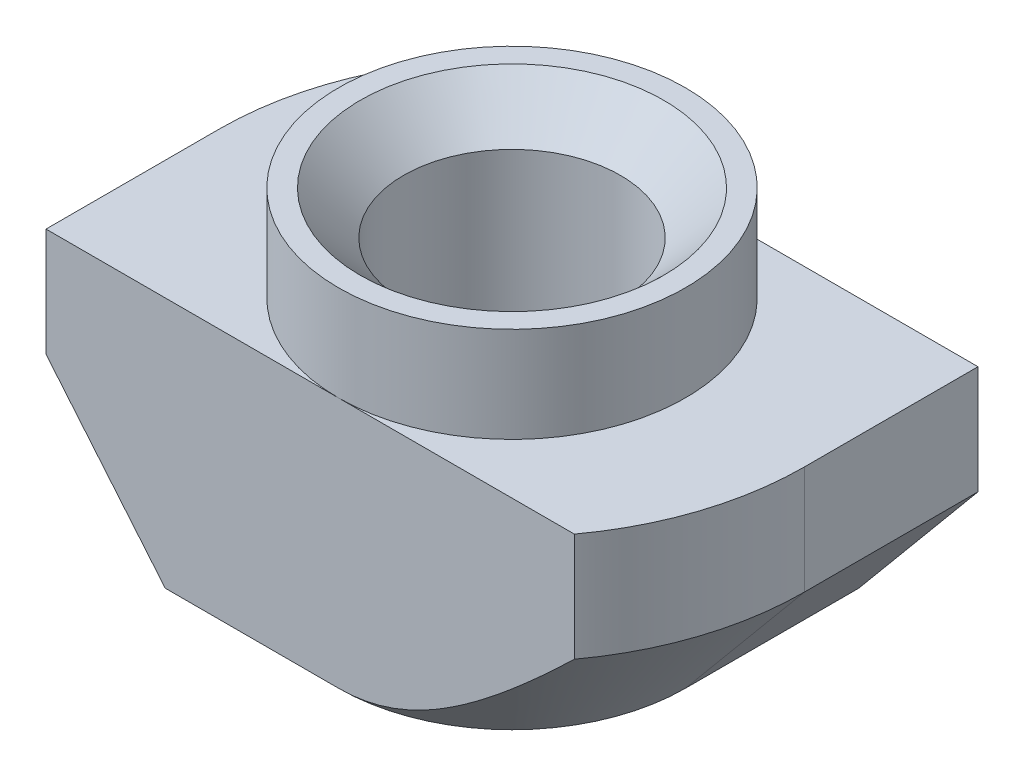
ISO-10303-21;
HEADER;
FILE_DESCRIPTION(('STEP AP214'),'2;1');
FILE_NAME('part.step','',(''),(''),'','','');
FILE_SCHEMA(('AUTOMOTIVE_DESIGN { 1 0 10303 214 1 1 1 1 }'));
ENDSEC;
DATA;
#1=APPLICATION_CONTEXT('core data for automotive mechanical design processes');
#2=APPLICATION_PROTOCOL_DEFINITION('international standard','automotive_design',2000,#1);
#3=PRODUCT_CONTEXT('',#1,'mechanical');
#4=PRODUCT('Part','Part','',(#3));
#5=PRODUCT_RELATED_PRODUCT_CATEGORY('part','',(#4));
#6=PRODUCT_DEFINITION_FORMATION('','',#4);
#7=PRODUCT_DEFINITION_CONTEXT('part definition',#1,'design');
#8=PRODUCT_DEFINITION('design','',#6,#7);
#9=PRODUCT_DEFINITION_SHAPE('','',#8);
#10=(LENGTH_UNIT() NAMED_UNIT(*) SI_UNIT(.MILLI.,.METRE.));
#11=(NAMED_UNIT(*) PLANE_ANGLE_UNIT() SI_UNIT($,.RADIAN.));
#12=(NAMED_UNIT(*) SI_UNIT($,.STERADIAN.) SOLID_ANGLE_UNIT());
#13=UNCERTAINTY_MEASURE_WITH_UNIT(LENGTH_MEASURE(1.E-05),#10,'distance_accuracy_value','');
#14=(GEOMETRIC_REPRESENTATION_CONTEXT(3) GLOBAL_UNCERTAINTY_ASSIGNED_CONTEXT((#13)) GLOBAL_UNIT_ASSIGNED_CONTEXT((#10,
#11,#12)) REPRESENTATION_CONTEXT('',''));
#15=CARTESIAN_POINT('',(0.,0.,0.));
#16=DIRECTION('',(0.,0.,1.));
#17=DIRECTION('',(1.,0.,0.));
#18=AXIS2_PLACEMENT_3D('',#15,#16,#17);
#19=CARTESIAN_POINT('',(-6.75,-2.2,4.));
#20=DIRECTION('',(1.,0.,0.));
#21=DIRECTION('',(0.,1.,0.));
#22=AXIS2_PLACEMENT_3D('',#19,#20,#21);
#23=PLANE('',#22);
#24=DIRECTION('',(0.,0.,-1.));
#25=VECTOR('',#24,1.);
#26=CARTESIAN_POINT('',(-6.75,-4.7,4.));
#27=LINE('',#26,#25);
#28=CARTESIAN_POINT('',(-6.75,-4.7,4.));
#29=VERTEX_POINT('',#28);
#30=CARTESIAN_POINT('',(-6.75,-4.7,0.));
#31=VERTEX_POINT('',#30);
#32=EDGE_CURVE('E205',#29,#31,#27,.T.);
#33=ORIENTED_EDGE('',*,*,#32,.F.);
#34=DIRECTION('',(0.,-1.,0.));
#35=VECTOR('',#34,1.);
#36=CARTESIAN_POINT('',(-6.75,-2.2,4.));
#37=LINE('',#36,#35);
#38=CARTESIAN_POINT('',(-6.75,-2.2,4.));
#39=VERTEX_POINT('',#38);
#40=EDGE_CURVE('E134',#39,#29,#37,.T.);
#41=ORIENTED_EDGE('',*,*,#40,.F.);
#42=DIRECTION('',(0.,0.,-1.));
#43=VECTOR('',#42,1.);
#44=CARTESIAN_POINT('',(-6.75,-2.2,4.));
#45=LINE('',#44,#43);
#46=CARTESIAN_POINT('',(-6.75,-2.2,0.));
#47=VERTEX_POINT('',#46);
#48=EDGE_CURVE('E12',#39,#47,#45,.T.);
#49=ORIENTED_EDGE('',*,*,#48,.T.);
#50=DIRECTION('',(0.,1.,0.));
#51=VECTOR('',#50,1.);
#52=CARTESIAN_POINT('',(-6.75,-8.,0.));
#53=LINE('',#52,#51);
#54=EDGE_CURVE('E206',#31,#47,#53,.T.);
#55=ORIENTED_EDGE('',*,*,#54,.F.);
#56=EDGE_LOOP('',(#33,#41,#49,#55));
#57=FACE_BOUND('',#56,.T.);
#58=ADVANCED_FACE('F38',(#57),#23,.F.);
#59=CARTESIAN_POINT('',(-6.75,-8.,4.));
#60=DIRECTION('',(0.,1.,0.));
#61=DIRECTION('',(0.,0.,1.));
#62=AXIS2_PLACEMENT_3D('',#59,#60,#61);
#63=PLANE('',#62);
#64=CARTESIAN_POINT('',(0.,-8.,0.));
#65=DIRECTION('',(0.,1.,0.));
#66=DIRECTION('',(0.,0.,1.));
#67=AXIS2_PLACEMENT_3D('',#64,#65,#66);
#68=CIRCLE('',#67,3.5);
#69=CARTESIAN_POINT('',(0.,-8.,3.5));
#70=VERTEX_POINT('',#69);
#71=EDGE_CURVE('E186',#70,#70,#68,.T.);
#72=ORIENTED_EDGE('',*,*,#71,.T.);
#73=EDGE_LOOP('',(#72));
#74=FACE_BOUND('',#73,.T.);
#75=DIRECTION('',(1.,0.,0.));
#76=VECTOR('',#75,1.);
#77=CARTESIAN_POINT('',(-6.75,-8.,4.));
#78=LINE('',#77,#76);
#79=CARTESIAN_POINT('',(-4.,-8.,4.));
#80=VERTEX_POINT('',#79);
#81=CARTESIAN_POINT('',(0.,-8.,4.));
#82=VERTEX_POINT('',#81);
#83=EDGE_CURVE('E132',#80,#82,#78,.T.);
#84=ORIENTED_EDGE('',*,*,#83,.F.);
#85=DIRECTION('',(0.,0.,-1.));
#86=VECTOR('',#85,1.);
#87=CARTESIAN_POINT('',(-4.,-8.,4.));
#88=LINE('',#87,#86);
#89=CARTESIAN_POINT('',(-4.,-8.,0.));
#90=VERTEX_POINT('',#89);
#91=EDGE_CURVE('E117',#80,#90,#88,.T.);
#92=ORIENTED_EDGE('',*,*,#91,.T.);
#93=CARTESIAN_POINT('',(0.,-8.,0.));
#94=DIRECTION('',(0.,-1.,0.));
#95=DIRECTION('',(-1.,0.,0.));
#96=AXIS2_PLACEMENT_3D('',#93,#94,#95);
#97=CIRCLE('',#96,4.);
#98=CARTESIAN_POINT('',(0.,-8.,-4.));
#99=VERTEX_POINT('',#98);
#100=EDGE_CURVE('E207',#90,#99,#97,.T.);
#101=ORIENTED_EDGE('',*,*,#100,.T.);
#102=DIRECTION('',(1.,0.,0.));
#103=VECTOR('',#102,1.);
#104=CARTESIAN_POINT('',(-6.75,-8.,-4.));
#105=LINE('',#104,#103);
#106=CARTESIAN_POINT('',(4.,-8.,-4.));
#107=VERTEX_POINT('',#106);
#108=EDGE_CURVE('E149',#99,#107,#105,.T.);
#109=ORIENTED_EDGE('',*,*,#108,.T.);
#110=DIRECTION('',(0.,0.,1.));
#111=VECTOR('',#110,1.);
#112=CARTESIAN_POINT('',(4.,-8.,-6.75));
#113=LINE('',#112,#111);
#114=CARTESIAN_POINT('',(4.,-8.,0.));
#115=VERTEX_POINT('',#114);
#116=EDGE_CURVE('E53',#107,#115,#113,.T.);
#117=ORIENTED_EDGE('',*,*,#116,.T.);
#118=CARTESIAN_POINT('',(0.,-8.,0.));
#119=DIRECTION('',(0.,-1.,0.));
#120=DIRECTION('',(1.,0.,0.));
#121=AXIS2_PLACEMENT_3D('',#118,#119,#120);
#122=CIRCLE('',#121,4.);
#123=EDGE_CURVE('E138',#115,#82,#122,.T.);
#124=ORIENTED_EDGE('',*,*,#123,.T.);
#125=EDGE_LOOP('',(#84,#92,#101,#109,#117,#124));
#126=FACE_BOUND('',#125,.T.);
#127=ADVANCED_FACE('F137',(#74,#126),#63,.F.);
#128=CARTESIAN_POINT('',(6.75,-2.2,4.));
#129=DIRECTION('',(-1.,0.,0.));
#130=DIRECTION('',(0.,-1.,0.));
#131=AXIS2_PLACEMENT_3D('',#128,#129,#130);
#132=PLANE('',#131);
#133=DIRECTION('',(0.,0.,1.));
#134=VECTOR('',#133,1.);
#135=CARTESIAN_POINT('',(6.75,-4.7,-6.75));
#136=LINE('',#135,#134);
#137=CARTESIAN_POINT('',(6.75,-4.7,-4.));
#138=VERTEX_POINT('',#137);
#139=CARTESIAN_POINT('',(6.75,-4.7,0.));
#140=VERTEX_POINT('',#139);
#141=EDGE_CURVE('E418',#138,#140,#136,.T.);
#142=ORIENTED_EDGE('',*,*,#141,.F.);
#143=DIRECTION('',(0.,1.,0.));
#144=VECTOR('',#143,1.);
#145=CARTESIAN_POINT('',(6.75,-2.2,-4.));
#146=LINE('',#145,#144);
#147=CARTESIAN_POINT('',(6.75,-2.2,-4.));
#148=VERTEX_POINT('',#147);
#149=EDGE_CURVE('E153',#138,#148,#146,.T.);
#150=ORIENTED_EDGE('',*,*,#149,.T.);
#151=DIRECTION('',(0.,0.,-1.));
#152=VECTOR('',#151,1.);
#153=CARTESIAN_POINT('',(6.75,-2.2,4.));
#154=LINE('',#153,#152);
#155=CARTESIAN_POINT('',(6.75,-2.2,0.));
#156=VERTEX_POINT('',#155);
#157=EDGE_CURVE('E46',#156,#148,#154,.T.);
#158=ORIENTED_EDGE('',*,*,#157,.F.);
#159=DIRECTION('',(0.,1.,0.));
#160=VECTOR('',#159,1.);
#161=CARTESIAN_POINT('',(6.75,-8.,0.));
#162=LINE('',#161,#160);
#163=EDGE_CURVE('E414',#140,#156,#162,.T.);
#164=ORIENTED_EDGE('',*,*,#163,.F.);
#165=EDGE_LOOP('',(#142,#150,#158,#164));
#166=FACE_BOUND('',#165,.T.);
#167=ADVANCED_FACE('F279',(#166),#132,.F.);
#168=CARTESIAN_POINT('',(0.,0.,4.));
#169=DIRECTION('',(0.,0.,-1.));
#170=DIRECTION('',(-1.,0.,0.));
#171=AXIS2_PLACEMENT_3D('',#168,#169,#170);
#172=PLANE('',#171);
#173=DIRECTION('',(-0.64018439966448,0.768221279597376,0.));
#174=VECTOR('',#173,1.);
#175=CARTESIAN_POINT('',(-4.,-8.,4.));
#176=LINE('',#175,#174);
#177=EDGE_CURVE('E120',#80,#29,#176,.T.);
#178=ORIENTED_EDGE('',*,*,#177,.F.);
#179=ORIENTED_EDGE('',*,*,#83,.T.);
#180=CARTESIAN_POINT('',(11.3671058523787,1.6604279833352,4.));
#181=CARTESIAN_POINT('',(11.0760860403435,1.33105236329668,4.));
#182=CARTESIAN_POINT('',(10.7844170425921,1.0022457486954,4.));
#183=CARTESIAN_POINT('',(10.1993231212537,0.346167668803112,4.));
#184=CARTESIAN_POINT('',(9.90589810454392,0.0188962865979481,4.));
#185=CARTESIAN_POINT('',(9.31636959174981,-0.634228413028052,4.));
#186=CARTESIAN_POINT('',(9.02026241673751,-0.960078413617772,4.));
#187=CARTESIAN_POINT('',(8.42520423771567,-1.60916385316204,4.));
#188=CARTESIAN_POINT('',(8.12625329733044,-1.93239935031355,4.));
#189=CARTESIAN_POINT('',(7.62113759930271,-2.4721099891261,4.));
#190=CARTESIAN_POINT('',(7.41599765243581,-2.68954364333778,4.));
#191=CARTESIAN_POINT('',(7.00354639223159,-3.12234172549854,4.));
#192=CARTESIAN_POINT('',(6.79623509747719,-3.3377061711262,4.));
#193=CARTESIAN_POINT('',(6.37905836666979,-3.76561209058286,4.));
#194=CARTESIAN_POINT('',(6.16919513057166,-3.97815570550829,4.));
#195=CARTESIAN_POINT('',(5.74601037812939,-4.39976961895935,4.));
#196=CARTESIAN_POINT('',(5.53268898786923,-4.60884004355697,4.));
#197=CARTESIAN_POINT('',(5.15124375070127,-4.97462048091292,4.));
#198=CARTESIAN_POINT('',(4.98403986804425,-5.13228814267081,4.));
#199=CARTESIAN_POINT('',(4.64631811321141,-5.44402840167018,4.));
#200=CARTESIAN_POINT('',(4.47580042417569,-5.598101196555,4.));
#201=CARTESIAN_POINT('',(4.13017207023597,-5.90188540217576,4.));
#202=CARTESIAN_POINT('',(3.95505126633798,-6.05158532538534,4.));
#203=CARTESIAN_POINT('',(3.59949530306292,-6.34453303438679,4.));
#204=CARTESIAN_POINT('',(3.41906102603611,-6.48778188155665,4.));
#205=CARTESIAN_POINT('',(3.08710238276612,-6.7382816415291,4.));
#206=CARTESIAN_POINT('',(2.9367791889699,-6.84711583647144,4.));
#207=CARTESIAN_POINT('',(2.63062968508205,-7.05697462965617,4.));
#208=CARTESIAN_POINT('',(2.47480119221121,-7.15799607845374,4.));
#209=CARTESIAN_POINT('',(2.15713415120621,-7.3489904492666,4.));
#210=CARTESIAN_POINT('',(1.99531682288903,-7.43899827290574,4.));
#211=CARTESIAN_POINT('',(1.66430471093152,-7.60421837809288,4.));
#212=CARTESIAN_POINT('',(1.49511815297165,-7.67944666473227,4.));
#213=CARTESIAN_POINT('',(1.22532028837003,-7.78104788986654,4.));
#214=CARTESIAN_POINT('',(1.1273143533449,-7.81434780581565,4.));
#215=CARTESIAN_POINT('',(0.929111702410566,-7.87355862683957,4.));
#216=CARTESIAN_POINT('',(0.828915970387746,-7.8994727797637,4.));
#217=CARTESIAN_POINT('',(0.626974776585255,-7.94285077714466,4.));
#218=CARTESIAN_POINT('',(0.525234247502404,-7.96033732003277,4.));
#219=CARTESIAN_POINT('',(0.320587377338076,-7.9861557277214,4.));
#220=CARTESIAN_POINT('',(0.217681101494288,-7.99448810227678,4.));
#221=CARTESIAN_POINT('',(0.0109646248512727,-8.00159180517583,4.));
#222=CARTESIAN_POINT('',(-0.0928474297287709,-8.00031009062098,4.));
#223=CARTESIAN_POINT('',(-0.299898814737338,-7.9881281506586,4.));
#224=CARTESIAN_POINT('',(-0.40313813276692,-7.97722771783069,4.));
#225=CARTESIAN_POINT('',(-0.608438421840278,-7.94633009665039,4.));
#226=CARTESIAN_POINT('',(-0.71049665003145,-7.92631491101996,4.));
#227=CARTESIAN_POINT('',(-0.912642818545191,-7.87808415322407,4.));
#228=CARTESIAN_POINT('',(-1.01273044558611,-7.84986728823619,4.));
#229=CARTESIAN_POINT('',(-1.26097022328073,-7.77010282363247,4.));
#230=CARTESIAN_POINT('',(-1.40765516117371,-7.71399045924579,4.));
#231=CARTESIAN_POINT('',(-1.69551109235078,-7.58908365745236,4.));
#232=CARTESIAN_POINT('',(-1.83667800442798,-7.52028004074414,4.));
#233=CARTESIAN_POINT('',(-2.11511367892286,-7.37234003071119,4.));
#234=CARTESIAN_POINT('',(-2.2523340884189,-7.29311364527057,4.));
#235=CARTESIAN_POINT('',(-2.52208605930552,-7.12722060395302,4.));
#236=CARTESIAN_POINT('',(-2.6546191958479,-7.04055648171835,4.));
#237=CARTESIAN_POINT('',(-2.95400047597727,-6.83527687212387,4.));
#238=CARTESIAN_POINT('',(-3.11952436318278,-6.7147399741869,4.));
#239=CARTESIAN_POINT('',(-3.44531861404335,-6.46672890623101,4.));
#240=CARTESIAN_POINT('',(-3.60558727407307,-6.33925252152669,4.));
#241=CARTESIAN_POINT('',(-3.9221474541375,-6.07893509202181,4.));
#242=CARTESIAN_POINT('',(-4.07843167821133,-5.94608521765208,4.));
#243=CARTESIAN_POINT('',(-4.38757291443555,-5.67645232979501,4.));
#244=CARTESIAN_POINT('',(-4.54042969785064,-5.53966905518858,4.));
#245=CARTESIAN_POINT('',(-4.83522877775952,-5.27046150562527,4.));
#246=CARTESIAN_POINT('',(-4.97731697077144,-5.1381965019456,4.));
#247=CARTESIAN_POINT('',(-5.25941894431438,-4.87146361855921,4.));
#248=CARTESIAN_POINT('',(-5.39943262931632,-4.73699563800422,4.));
#249=CARTESIAN_POINT('',(-5.67711404789033,-4.46686346687586,4.));
#250=CARTESIAN_POINT('',(-5.81478933960528,-4.33120702987574,4.));
#251=CARTESIAN_POINT('',(-6.08865443408717,-4.05843440191746,4.));
#252=CARTESIAN_POINT('',(-6.224844412109,-3.92131838703406,4.));
#253=CARTESIAN_POINT('',(-6.36042798333519,-3.78361139097708,4.));
#254=B_SPLINE_CURVE_WITH_KNOTS('',3,(#180,#181,#182,#183,#184,#185,#186,#187,#188,#189,#190,
#191,#192,#193,#194,#195,#196,#197,#198,#199,#200,#201,#202,#203,#204,#205,#206,#207,#208,#209,
#210,#211,#212,#213,#214,#215,#216,#217,#218,#219,#220,#221,#222,#223,#224,#225,#226,#227,#228,
#229,#230,#231,#232,#233,#234,#235,#236,#237,#238,#239,#240,#241,#242,#243,#244,#245,#246,#247,
#248,#249,#250,#251,#252,#253),.UNSPECIFIED.,.F.,.F.,(4,2,2,2,2,2,2,2,2,2,2,2,2,2,2,2,2,2,2,2,2,
2,2,2,2,2,2,2,2,2,2,2,2,2,2,2,4),(0.,1.31857462633975,2.63721980838195,3.95808596325466,
5.2789226352314,6.17570450954513,7.07247871524691,7.96852805964379,8.86454480731277,
9.55395925437611,10.2433357081569,10.9343845914659,11.6253193598719,12.1818961728885,
12.7386961940615,13.2936833492167,13.8480661428148,14.1583551805519,14.4685075590911,
14.7778198572062,15.0871149302236,15.398117697584,15.7091271716476,16.0207534213141,
16.3324288189748,16.8027542480267,17.2734211964924,17.7484574522495,18.223332525822,
18.8373538413049,19.4515722792289,20.066844614587,20.6821578895728,21.2644939095022,
21.846856662618,22.4266847622442,23.006443690165),.UNSPECIFIED.);
#255=CARTESIAN_POINT('',(5.43714079273289,-4.7,4.));
#256=VERTEX_POINT('',#255);
#257=EDGE_CURVE('E216',#256,#82,#254,.T.);
#258=ORIENTED_EDGE('',*,*,#257,.F.);
#259=DIRECTION('',(0.,1.,0.));
#260=VECTOR('',#259,1.);
#261=CARTESIAN_POINT('',(5.43714079273289,-8.,4.));
#262=LINE('',#261,#260);
#263=CARTESIAN_POINT('',(5.43714079273289,-2.2,4.));
#264=VERTEX_POINT('',#263);
#265=EDGE_CURVE('E413',#256,#264,#262,.T.);
#266=ORIENTED_EDGE('',*,*,#265,.T.);
#267=DIRECTION('',(-1.,0.,0.));
#268=VECTOR('',#267,1.);
#269=CARTESIAN_POINT('',(4.,-2.2,4.));
#270=LINE('',#269,#268);
#271=CARTESIAN_POINT('',(0.,-2.2,4.));
#272=VERTEX_POINT('',#271);
#273=EDGE_CURVE('E139',#264,#272,#270,.T.);
#274=ORIENTED_EDGE('',*,*,#273,.T.);
#275=DIRECTION('',(-1.,0.,0.));
#276=VECTOR('',#275,1.);
#277=CARTESIAN_POINT('',(-4.,-2.2,4.));
#278=LINE('',#277,#276);
#279=EDGE_CURVE('E142',#272,#39,#278,.T.);
#280=ORIENTED_EDGE('',*,*,#279,.T.);
#281=ORIENTED_EDGE('',*,*,#40,.T.);
#282=EDGE_LOOP('',(#178,#179,#258,#266,#274,#280,#281));
#283=FACE_BOUND('',#282,.T.);
#284=ADVANCED_FACE('F130',(#283),#172,.F.);
#285=CARTESIAN_POINT('',(0.,0.,-4.));
#286=DIRECTION('',(0.,0.,-1.));
#287=DIRECTION('',(-1.,0.,0.));
#288=AXIS2_PLACEMENT_3D('',#285,#286,#287);
#289=PLANE('',#288);
#290=ORIENTED_EDGE('',*,*,#108,.F.);
#291=CARTESIAN_POINT('',(6.36042798333519,-3.78361139097707,-4.));
#292=CARTESIAN_POINT('',(6.19096575336858,-3.95569840243713,-4.));
#293=CARTESIAN_POINT('',(6.02057434282416,-4.12688678135177,-4.));
#294=CARTESIAN_POINT('',(5.67733276321281,-4.46690600025116,-4.));
#295=CARTESIAN_POINT('',(5.50448170584883,-4.63573594250527,-4.));
#296=CARTESIAN_POINT('',(5.15343455302278,-4.972663262347,-4.));
#297=CARTESIAN_POINT('',(4.9751975969079,-5.14071821849171,-4.));
#298=CARTESIAN_POINT('',(4.6149498607722,-5.47268321242632,-4.));
#299=CARTESIAN_POINT('',(4.43293975985162,-5.63659398450987,-4.));
#300=CARTESIAN_POINT('',(4.06675827990445,-5.95652898831325,-4.));
#301=CARTESIAN_POINT('',(3.88265752383698,-6.11263353638464,-4.));
#302=CARTESIAN_POINT('',(3.50828453614381,-6.41749747866301,-4.));
#303=CARTESIAN_POINT('',(3.31800926609262,-6.56625316287942,-4.));
#304=CARTESIAN_POINT('',(2.93035124990496,-6.85259362520673,-4.));
#305=CARTESIAN_POINT('',(2.73300275139348,-6.99022387683537,-4.));
#306=CARTESIAN_POINT('',(2.42953473468976,-7.18489735123375,-4.));
#307=CARTESIAN_POINT('',(2.32717967179717,-7.24780404036723,-4.));
#308=CARTESIAN_POINT('',(2.11966414757884,-7.36879189976334,-4.));
#309=CARTESIAN_POINT('',(2.01450430910475,-7.4268741297905,-4.));
#310=CARTESIAN_POINT('',(1.80835156000338,-7.53336911111571,-4.));
#311=CARTESIAN_POINT('',(1.70756069861796,-7.58217066418254,-4.));
#312=CARTESIAN_POINT('',(1.50316245831686,-7.67352703006457,-4.));
#313=CARTESIAN_POINT('',(1.39955510653057,-7.7160819030247,-4.));
#314=CARTESIAN_POINT('',(1.18972908518557,-7.79360961328778,-4.));
#315=CARTESIAN_POINT('',(1.08351559358896,-7.82859631293787,-4.));
#316=CARTESIAN_POINT('',(0.868583618519514,-7.88973401493709,-4.));
#317=CARTESIAN_POINT('',(0.759866032508893,-7.91588813180793,-4.));
#318=CARTESIAN_POINT('',(0.538694027528681,-7.95846494602781,-4.));
#319=CARTESIAN_POINT('',(0.426207628128944,-7.9747242726588,-4.));
#320=CARTESIAN_POINT('',(0.200169904733209,-7.99589452771145,-4.));
#321=CARTESIAN_POINT('',(0.0866187330024983,-8.00080705463661,-4.));
#322=CARTESIAN_POINT('',(-0.14030246546195,-7.99897680276572,-4.));
#323=CARTESIAN_POINT('',(-0.253672564281047,-7.99224288233528,-4.));
#324=CARTESIAN_POINT('',(-0.479183052625283,-7.96756047116108,-4.));
#325=CARTESIAN_POINT('',(-0.591323194273916,-7.94960976064056,-4.));
#326=CARTESIAN_POINT('',(-0.828679638026792,-7.90034905554965,-4.));
#327=CARTESIAN_POINT('',(-0.953583231400814,-7.86754605043562,-4.));
#328=CARTESIAN_POINT('',(-1.19986914543705,-7.79073406538926,-4.));
#329=CARTESIAN_POINT('',(-1.3212503989237,-7.74672172800898,-4.));
#330=CARTESIAN_POINT('',(-1.56082541702524,-7.64930064968035,-4.));
#331=CARTESIAN_POINT('',(-1.67900070300678,-7.59584703461212,-4.));
#332=CARTESIAN_POINT('',(-1.91163789661902,-7.48153602858787,-4.));
#333=CARTESIAN_POINT('',(-2.02610074298846,-7.42068052807702,-4.));
#334=CARTESIAN_POINT('',(-2.24982698084,-7.29408545468892,-4.));
#335=CARTESIAN_POINT('',(-2.35914453198821,-7.2284408283964,-4.));
#336=CARTESIAN_POINT('',(-2.57488733972282,-7.09253769210792,-4.));
#337=CARTESIAN_POINT('',(-2.68131199183111,-7.02227822815051,-4.));
#338=CARTESIAN_POINT('',(-2.89169764431045,-6.87797184251119,-4.));
#339=CARTESIAN_POINT('',(-2.99565622808834,-6.80392141347488,-4.));
#340=CARTESIAN_POINT('',(-3.2013375457822,-6.65277039463402,-4.));
#341=CARTESIAN_POINT('',(-3.3030600621233,-6.57566951003837,-4.));
#342=CARTESIAN_POINT('',(-3.60604350367824,-6.34006161951297,-4.));
#343=CARTESIAN_POINT('',(-3.80436678812835,-6.17777759521849,-4.));
#344=CARTESIAN_POINT('',(-4.19495816162702,-5.8463449975692,-4.));
#345=CARTESIAN_POINT('',(-4.38722911257422,-5.67719975790317,-4.));
#346=CARTESIAN_POINT('',(-4.76932607132929,-5.33194003602518,-4.));
#347=CARTESIAN_POINT('',(-4.95910052151099,-5.15576868961153,-4.));
#348=CARTESIAN_POINT('',(-5.33502188706818,-4.79957417522254,-4.));
#349=CARTESIAN_POINT('',(-5.52116842133824,-4.61955060670181,-4.));
#350=CARTESIAN_POINT('',(-5.89016183920031,-4.25697547690541,-4.));
#351=CARTESIAN_POINT('',(-6.07301515093437,-4.07443044237156,-4.));
#352=CARTESIAN_POINT('',(-6.43641169237051,-3.7070540660433,-4.));
#353=CARTESIAN_POINT('',(-6.61695488536694,-3.52222268801255,-4.));
#354=CARTESIAN_POINT('',(-6.99538489166774,-3.13085659403494,-4.));
#355=CARTESIAN_POINT('',(-7.19305928569326,-2.92411671759019,-4.));
#356=CARTESIAN_POINT('',(-7.58653956245801,-2.50886514282632,-4.));
#357=CARTESIAN_POINT('',(-7.78234542570909,-2.3003534260703,-4.));
#358=CARTESIAN_POINT('',(-8.367762944238,-1.67239202502907,-4.));
#359=CARTESIAN_POINT('',(-8.7550896613572,-1.25081288986206,-4.));
#360=CARTESIAN_POINT('',(-9.51490357897524,-0.415499947766777,-4.));
#361=CARTESIAN_POINT('',(-9.88750555068452,-0.00187016028489452,-4.));
#362=CARTESIAN_POINT('',(-10.4440554129111,0.620367028404783,-4.));
#363=CARTESIAN_POINT('',(-10.6291035911556,0.827991694286216,-4.));
#364=CARTESIAN_POINT('',(-10.9985605428931,1.24380681047688,-4.));
#365=CARTESIAN_POINT('',(-11.1829693205407,1.45199725709403,-4.));
#366=CARTESIAN_POINT('',(-11.3671058523788,1.66042798333522,-4.));
#367=B_SPLINE_CURVE_WITH_KNOTS('',3,(#291,#292,#293,#294,#295,#296,#297,#298,#299,#300,#301,
#302,#303,#304,#305,#306,#307,#308,#309,#310,#311,#312,#313,#314,#315,#316,#317,#318,#319,#320,
#321,#322,#323,#324,#325,#326,#327,#328,#329,#330,#331,#332,#333,#334,#335,#336,#337,#338,#339,
#340,#341,#342,#343,#344,#345,#346,#347,#348,#349,#350,#351,#352,#353,#354,#355,#356,#357,#358,
#359,#360,#361,#362,#363,#364,#365,#366),.UNSPECIFIED.,.F.,.F.,(4,2,2,2,2,2,2,2,2,2,2,2,2,2,2,2,
2,2,2,2,2,2,2,2,2,2,2,2,2,2,2,2,2,2,2,2,2,4),(0.,0.724570694082745,1.44941006424093,
2.18427371550557,2.9190062331236,3.64298504327244,4.3673256871961,5.08853781395851,
5.44885986155676,5.8091025485538,6.14487928433326,6.48065278694036,6.8158059576366,
7.15084082381942,7.49126707240273,7.83164535981976,8.17176486708144,8.51195170453121,
8.89873227102634,9.28562882355322,9.67441635667138,10.0631048009477,10.445504788757,
10.8279840751224,11.2108238573614,11.5937007274213,12.3622116617607,13.1303535669006,
13.9071050075758,14.6839376093844,15.4590392555737,16.2341532021534,17.0922460992291,
17.9503479361577,19.667785634447,21.3378879891101,22.1722473665305,23.0066013122183),.UNSPECIFIED.);
#368=CARTESIAN_POINT('',(-5.43714079273289,-4.7,-4.));
#369=VERTEX_POINT('',#368);
#370=EDGE_CURVE('E224',#99,#369,#367,.T.);
#371=ORIENTED_EDGE('',*,*,#370,.T.);
#372=DIRECTION('',(0.,1.,0.));
#373=VECTOR('',#372,1.);
#374=CARTESIAN_POINT('',(-5.43714079273289,-8.,-4.));
#375=LINE('',#374,#373);
#376=CARTESIAN_POINT('',(-5.43714079273289,-2.2,-4.));
#377=VERTEX_POINT('',#376);
#378=EDGE_CURVE('E176',#369,#377,#375,.T.);
#379=ORIENTED_EDGE('',*,*,#378,.T.);
#380=DIRECTION('',(-1.,0.,0.));
#381=VECTOR('',#380,1.);
#382=CARTESIAN_POINT('',(-4.,-2.2,-4.));
#383=LINE('',#382,#381);
#384=CARTESIAN_POINT('',(0.,-2.2,-4.));
#385=VERTEX_POINT('',#384);
#386=EDGE_CURVE('E146',#385,#377,#383,.T.);
#387=ORIENTED_EDGE('',*,*,#386,.F.);
#388=DIRECTION('',(-1.,0.,0.));
#389=VECTOR('',#388,1.);
#390=CARTESIAN_POINT('',(4.,-2.2,-4.));
#391=LINE('',#390,#389);
#392=EDGE_CURVE('E155',#148,#385,#391,.T.);
#393=ORIENTED_EDGE('',*,*,#392,.F.);
#394=ORIENTED_EDGE('',*,*,#149,.F.);
#395=DIRECTION('',(-0.64018439966448,-0.768221279597376,0.));
#396=VECTOR('',#395,1.);
#397=CARTESIAN_POINT('',(6.29508196721311,-5.24590163934426,-4.));
#398=LINE('',#397,#396);
#399=EDGE_CURVE('E214',#138,#107,#398,.T.);
#400=ORIENTED_EDGE('',*,*,#399,.T.);
#401=EDGE_LOOP('',(#290,#371,#379,#387,#393,#394,#400));
#402=FACE_BOUND('',#401,.T.);
#403=ADVANCED_FACE('F173',(#402),#289,.T.);
#404=CARTESIAN_POINT('',(0.,-8.,0.));
#405=DIRECTION('',(0.,1.,0.));
#406=DIRECTION('',(-1.,0.,0.));
#407=AXIS2_PLACEMENT_3D('',#404,#405,#406);
#408=CYLINDRICAL_SURFACE('',#407,6.75);
#409=CARTESIAN_POINT('',(0.,-4.7,0.));
#410=DIRECTION('',(0.,-1.,0.));
#411=DIRECTION('',(-1.,0.,0.));
#412=AXIS2_PLACEMENT_3D('',#409,#410,#411);
#413=CIRCLE('',#412,6.75);
#414=EDGE_CURVE('E61',#31,#369,#413,.T.);
#415=ORIENTED_EDGE('',*,*,#414,.F.);
#416=ORIENTED_EDGE('',*,*,#54,.T.);
#417=CARTESIAN_POINT('',(0.,-2.2,0.));
#418=DIRECTION('',(0.,-1.,0.));
#419=DIRECTION('',(-1.,0.,0.));
#420=AXIS2_PLACEMENT_3D('',#417,#418,#419);
#421=CIRCLE('',#420,6.75);
#422=EDGE_CURVE('E202',#47,#377,#421,.T.);
#423=ORIENTED_EDGE('',*,*,#422,.T.);
#424=ORIENTED_EDGE('',*,*,#378,.F.);
#425=EDGE_LOOP('',(#415,#416,#423,#424));
#426=FACE_BOUND('',#425,.T.);
#427=ADVANCED_FACE('F247',(#426),#408,.T.);
#428=CARTESIAN_POINT('',(0.,-8.,0.));
#429=DIRECTION('',(0.,1.,0.));
#430=DIRECTION('',(-1.,0.,0.));
#431=AXIS2_PLACEMENT_3D('',#428,#429,#430);
#432=CYLINDRICAL_SURFACE('',#431,6.75);
#433=CARTESIAN_POINT('',(0.,-4.7,0.));
#434=DIRECTION('',(0.,-1.,0.));
#435=DIRECTION('',(1.,0.,0.));
#436=AXIS2_PLACEMENT_3D('',#433,#434,#435);
#437=CIRCLE('',#436,6.75);
#438=EDGE_CURVE('E212',#140,#256,#437,.T.);
#439=ORIENTED_EDGE('',*,*,#438,.F.);
#440=ORIENTED_EDGE('',*,*,#163,.T.);
#441=CARTESIAN_POINT('',(0.,-2.2,0.));
#442=DIRECTION('',(0.,-1.,0.));
#443=DIRECTION('',(1.,0.,0.));
#444=AXIS2_PLACEMENT_3D('',#441,#442,#443);
#445=CIRCLE('',#444,6.75);
#446=EDGE_CURVE('E167',#156,#264,#445,.T.);
#447=ORIENTED_EDGE('',*,*,#446,.T.);
#448=ORIENTED_EDGE('',*,*,#265,.F.);
#449=EDGE_LOOP('',(#439,#440,#447,#448));
#450=FACE_BOUND('',#449,.T.);
#451=ADVANCED_FACE('F250',(#450),#432,.T.);
#452=CARTESIAN_POINT('',(4.,0.,4.));
#453=DIRECTION('',(0.,-1.,0.));
#454=DIRECTION('',(0.,0.,-1.));
#455=AXIS2_PLACEMENT_3D('',#452,#453,#454);
#456=PLANE('',#455);
#457=CARTESIAN_POINT('',(0.,0.,0.));
#458=DIRECTION('',(0.,1.,0.));
#459=DIRECTION('',(0.,0.,1.));
#460=AXIS2_PLACEMENT_3D('',#457,#458,#459);
#461=CIRCLE('',#460,3.5);
#462=CARTESIAN_POINT('',(0.,0.,3.5));
#463=VERTEX_POINT('',#462);
#464=EDGE_CURVE('E189',#463,#463,#461,.T.);
#465=ORIENTED_EDGE('',*,*,#464,.F.);
#466=EDGE_LOOP('',(#465));
#467=FACE_BOUND('',#466,.T.);
#468=CARTESIAN_POINT('',(0.,0.,0.));
#469=DIRECTION('',(0.,1.,0.));
#470=DIRECTION('',(0.,0.,1.));
#471=AXIS2_PLACEMENT_3D('',#468,#469,#470);
#472=CIRCLE('',#471,4.);
#473=CARTESIAN_POINT('',(0.,0.,4.));
#474=VERTEX_POINT('',#473);
#475=EDGE_CURVE('E191',#474,#474,#472,.T.);
#476=ORIENTED_EDGE('',*,*,#475,.T.);
#477=EDGE_LOOP('',(#476));
#478=FACE_BOUND('',#477,.T.);
#479=ADVANCED_FACE('F254',(#467,#478),#456,.F.);
#480=CARTESIAN_POINT('',(-4.,-2.2,4.));
#481=DIRECTION('',(0.,-1.,0.));
#482=DIRECTION('',(1.,0.,0.));
#483=AXIS2_PLACEMENT_3D('',#480,#481,#482);
#484=PLANE('',#483);
#485=ORIENTED_EDGE('',*,*,#386,.T.);
#486=ORIENTED_EDGE('',*,*,#422,.F.);
#487=ORIENTED_EDGE('',*,*,#48,.F.);
#488=ORIENTED_EDGE('',*,*,#279,.F.);
#489=CARTESIAN_POINT('',(0.,-2.2,0.));
#490=DIRECTION('',(0.,-1.,0.));
#491=DIRECTION('',(1.,0.,0.));
#492=AXIS2_PLACEMENT_3D('',#489,#490,#491);
#493=CIRCLE('',#492,4.);
#494=EDGE_CURVE('E184',#385,#272,#493,.F.);
#495=ORIENTED_EDGE('',*,*,#494,.F.);
#496=EDGE_LOOP('',(#485,#486,#487,#488,#495));
#497=FACE_BOUND('',#496,.T.);
#498=ADVANCED_FACE('F40',(#497),#484,.F.);
#499=CARTESIAN_POINT('',(4.,-2.2,4.));
#500=DIRECTION('',(0.,-1.,0.));
#501=DIRECTION('',(1.,0.,0.));
#502=AXIS2_PLACEMENT_3D('',#499,#500,#501);
#503=PLANE('',#502);
#504=ORIENTED_EDGE('',*,*,#273,.F.);
#505=ORIENTED_EDGE('',*,*,#446,.F.);
#506=ORIENTED_EDGE('',*,*,#157,.T.);
#507=ORIENTED_EDGE('',*,*,#392,.T.);
#508=EDGE_CURVE('E182',#272,#385,#493,.F.);
#509=ORIENTED_EDGE('',*,*,#508,.F.);
#510=EDGE_LOOP('',(#504,#505,#506,#507,#509));
#511=FACE_BOUND('',#510,.T.);
#512=ADVANCED_FACE('F163',(#511),#503,.F.);
#513=CARTESIAN_POINT('',(0.,-7.,0.));
#514=DIRECTION('',(0.,-1.,0.));
#515=DIRECTION('',(0.,0.,-1.));
#516=AXIS2_PLACEMENT_3D('',#513,#514,#515);
#517=CONICAL_SURFACE('',#516,2.5,0.785398163397448);
#518=ORIENTED_EDGE('',*,*,#71,.F.);
#519=EDGE_LOOP('',(#518));
#520=FACE_BOUND('',#519,.T.);
#521=CARTESIAN_POINT('',(0.,-7.,0.));
#522=DIRECTION('',(0.,1.,0.));
#523=DIRECTION('',(0.,0.,1.));
#524=AXIS2_PLACEMENT_3D('',#521,#522,#523);
#525=CIRCLE('',#524,2.5);
#526=CARTESIAN_POINT('',(0.,-7.,2.5));
#527=VERTEX_POINT('',#526);
#528=EDGE_CURVE('E150',#527,#527,#525,.T.);
#529=ORIENTED_EDGE('',*,*,#528,.T.);
#530=EDGE_LOOP('',(#529));
#531=FACE_BOUND('',#530,.T.);
#532=ADVANCED_FACE('F265',(#520,#531),#517,.F.);
#533=CARTESIAN_POINT('',(0.,0.,0.));
#534=DIRECTION('',(0.,1.,0.));
#535=DIRECTION('',(0.,0.,1.));
#536=AXIS2_PLACEMENT_3D('',#533,#534,#535);
#537=CYLINDRICAL_SURFACE('',#536,2.5);
#538=ORIENTED_EDGE('',*,*,#528,.F.);
#539=EDGE_LOOP('',(#538));
#540=FACE_BOUND('',#539,.T.);
#541=CARTESIAN_POINT('',(0.,-0.999999999999999,0.));
#542=DIRECTION('',(0.,1.,0.));
#543=DIRECTION('',(0.,0.,1.));
#544=AXIS2_PLACEMENT_3D('',#541,#542,#543);
#545=CIRCLE('',#544,2.5);
#546=CARTESIAN_POINT('',(0.,-0.999999999999999,2.5));
#547=VERTEX_POINT('',#546);
#548=EDGE_CURVE('E197',#547,#547,#545,.T.);
#549=ORIENTED_EDGE('',*,*,#548,.T.);
#550=EDGE_LOOP('',(#549));
#551=FACE_BOUND('',#550,.T.);
#552=ADVANCED_FACE('F262',(#540,#551),#537,.F.);
#553=CARTESIAN_POINT('',(0.,0.,0.));
#554=DIRECTION('',(0.,1.,0.));
#555=DIRECTION('',(0.,0.,1.));
#556=AXIS2_PLACEMENT_3D('',#553,#554,#555);
#557=CONICAL_SURFACE('',#556,3.5,0.785398163397449);
#558=ORIENTED_EDGE('',*,*,#548,.F.);
#559=EDGE_LOOP('',(#558));
#560=FACE_BOUND('',#559,.T.);
#561=ORIENTED_EDGE('',*,*,#464,.T.);
#562=EDGE_LOOP('',(#561));
#563=FACE_BOUND('',#562,.T.);
#564=ADVANCED_FACE('F258',(#560,#563),#557,.F.);
#565=CARTESIAN_POINT('',(0.,-18.0594837557847,0.));
#566=DIRECTION('',(0.,1.,0.));
#567=DIRECTION('',(0.,0.,1.));
#568=AXIS2_PLACEMENT_3D('',#565,#566,#567);
#569=CYLINDRICAL_SURFACE('',#568,4.);
#570=ORIENTED_EDGE('',*,*,#475,.F.);
#571=EDGE_LOOP('',(#570));
#572=FACE_BOUND('',#571,.T.);
#573=ORIENTED_EDGE('',*,*,#508,.T.);
#574=ORIENTED_EDGE('',*,*,#494,.T.);
#575=EDGE_LOOP('',(#573,#574));
#576=FACE_BOUND('',#575,.T.);
#577=ADVANCED_FACE('F183',(#572,#576),#569,.T.);
#578=CARTESIAN_POINT('',(4.,-8.,-6.75));
#579=DIRECTION('',(0.768221279597376,-0.64018439966448,0.));
#580=DIRECTION('',(0.64018439966448,0.768221279597376,0.));
#581=AXIS2_PLACEMENT_3D('',#578,#579,#580);
#582=PLANE('',#581);
#583=ORIENTED_EDGE('',*,*,#141,.T.);
#584=DIRECTION('',(0.64018439966448,0.768221279597376,0.));
#585=VECTOR('',#584,1.);
#586=CARTESIAN_POINT('',(4.,-8.,0.));
#587=LINE('',#586,#585);
#588=EDGE_CURVE('E420',#115,#140,#587,.T.);
#589=ORIENTED_EDGE('',*,*,#588,.F.);
#590=ORIENTED_EDGE('',*,*,#116,.F.);
#591=ORIENTED_EDGE('',*,*,#399,.F.);
#592=EDGE_LOOP('',(#583,#589,#590,#591));
#593=FACE_BOUND('',#592,.T.);
#594=ADVANCED_FACE('F238',(#593),#582,.T.);
#595=CARTESIAN_POINT('',(0.,-8.,0.));
#596=DIRECTION('',(0.,1.,0.));
#597=DIRECTION('',(0.,0.,1.));
#598=AXIS2_PLACEMENT_3D('',#595,#596,#597);
#599=CONICAL_SURFACE('',#598,4.,0.694738276196703);
#600=ORIENTED_EDGE('',*,*,#257,.T.);
#601=ORIENTED_EDGE('',*,*,#123,.F.);
#602=ORIENTED_EDGE('',*,*,#588,.T.);
#603=ORIENTED_EDGE('',*,*,#438,.T.);
#604=EDGE_LOOP('',(#600,#601,#602,#603));
#605=FACE_BOUND('',#604,.T.);
#606=ADVANCED_FACE('F234',(#605),#599,.T.);
#607=CARTESIAN_POINT('',(-4.,-8.,4.));
#608=DIRECTION('',(-0.768221279597376,-0.64018439966448,0.));
#609=DIRECTION('',(0.64018439966448,-0.768221279597376,0.));
#610=AXIS2_PLACEMENT_3D('',#607,#608,#609);
#611=PLANE('',#610);
#612=ORIENTED_EDGE('',*,*,#32,.T.);
#613=DIRECTION('',(-0.64018439966448,0.768221279597376,0.));
#614=VECTOR('',#613,1.);
#615=CARTESIAN_POINT('',(-4.,-8.,0.));
#616=LINE('',#615,#614);
#617=EDGE_CURVE('E122',#90,#31,#616,.T.);
#618=ORIENTED_EDGE('',*,*,#617,.F.);
#619=ORIENTED_EDGE('',*,*,#91,.F.);
#620=ORIENTED_EDGE('',*,*,#177,.T.);
#621=EDGE_LOOP('',(#612,#618,#619,#620));
#622=FACE_BOUND('',#621,.T.);
#623=ADVANCED_FACE('F119',(#622),#611,.T.);
#624=CARTESIAN_POINT('',(0.,-8.,0.));
#625=DIRECTION('',(0.,1.,0.));
#626=DIRECTION('',(0.,0.,1.));
#627=AXIS2_PLACEMENT_3D('',#624,#625,#626);
#628=CONICAL_SURFACE('',#627,4.,0.694738276196703);
#629=ORIENTED_EDGE('',*,*,#100,.F.);
#630=ORIENTED_EDGE('',*,*,#617,.T.);
#631=ORIENTED_EDGE('',*,*,#414,.T.);
#632=ORIENTED_EDGE('',*,*,#370,.F.);
#633=EDGE_LOOP('',(#629,#630,#631,#632));
#634=FACE_BOUND('',#633,.T.);
#635=ADVANCED_FACE('F240',(#634),#628,.T.);
#636=CLOSED_SHELL('',(#58,#127,#167,#284,#403,#427,#451,#479,#498,#512,#532,#552,#564,#577,#594,
#606,#623,#635));
#637=MANIFOLD_SOLID_BREP('B2',#636);
#638=ADVANCED_BREP_SHAPE_REPRESENTATION('',(#18,#637),#14);
#639=SHAPE_DEFINITION_REPRESENTATION(#9,#638);
ENDSEC;
END-ISO-10303-21;
